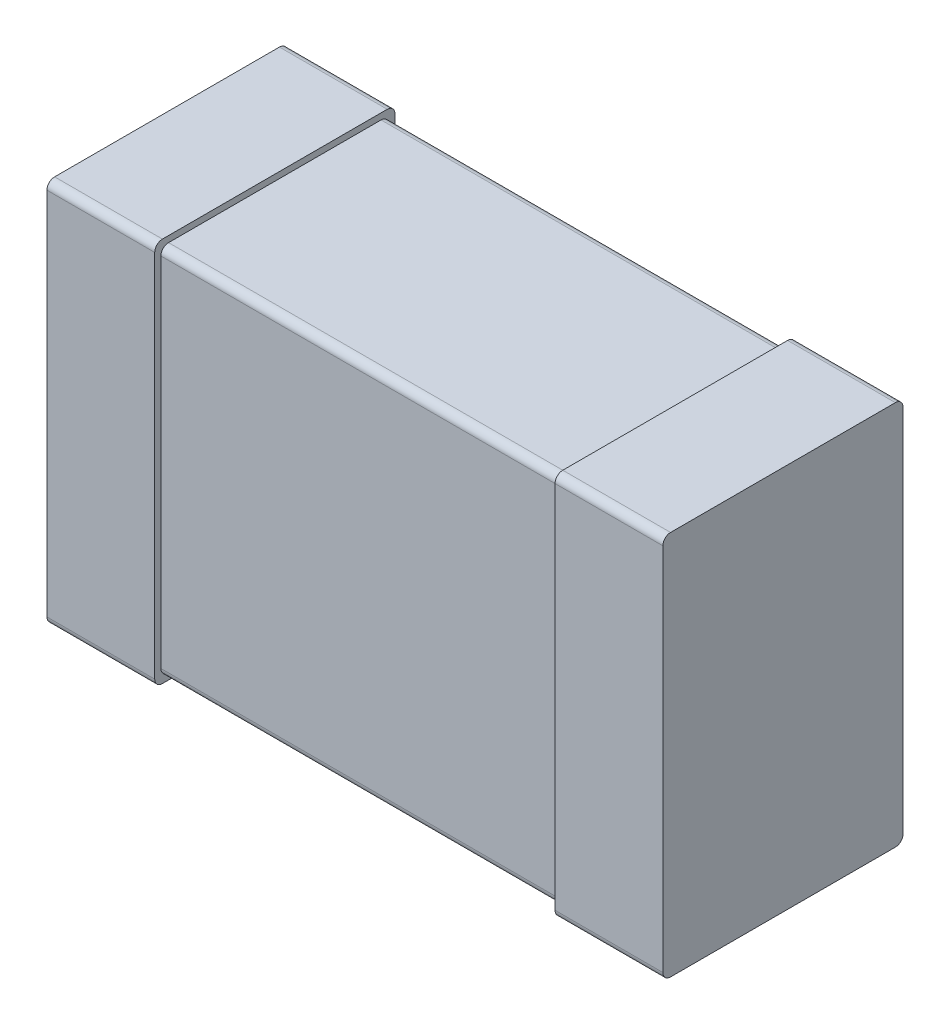
ISO-10303-21;
HEADER;
FILE_DESCRIPTION(('STEP AP214'),'2;1');
FILE_NAME('part.step','',(''),(''),'','','');
FILE_SCHEMA(('AUTOMOTIVE_DESIGN { 1 0 10303 214 1 1 1 1 }'));
ENDSEC;
DATA;
#1=APPLICATION_CONTEXT('core data for automotive mechanical design processes');
#2=APPLICATION_PROTOCOL_DEFINITION('international standard','automotive_design',2000,#1);
#3=PRODUCT_CONTEXT('',#1,'mechanical');
#4=PRODUCT('Part','Part','',(#3));
#5=PRODUCT_RELATED_PRODUCT_CATEGORY('part','',(#4));
#6=PRODUCT_DEFINITION_FORMATION('','',#4);
#7=PRODUCT_DEFINITION_CONTEXT('part definition',#1,'design');
#8=PRODUCT_DEFINITION('design','',#6,#7);
#9=PRODUCT_DEFINITION_SHAPE('','',#8);
#10=(LENGTH_UNIT() NAMED_UNIT(*) SI_UNIT(.MILLI.,.METRE.));
#11=(NAMED_UNIT(*) PLANE_ANGLE_UNIT() SI_UNIT($,.RADIAN.));
#12=(NAMED_UNIT(*) SI_UNIT($,.STERADIAN.) SOLID_ANGLE_UNIT());
#13=UNCERTAINTY_MEASURE_WITH_UNIT(LENGTH_MEASURE(1.E-05),#10,'distance_accuracy_value','');
#14=(GEOMETRIC_REPRESENTATION_CONTEXT(3) GLOBAL_UNCERTAINTY_ASSIGNED_CONTEXT((#13)) GLOBAL_UNIT_ASSIGNED_CONTEXT((#10,
#11,#12)) REPRESENTATION_CONTEXT('',''));
#15=CARTESIAN_POINT('',(0.,0.,0.));
#16=DIRECTION('',(0.,0.,1.));
#17=DIRECTION('',(1.,0.,0.));
#18=AXIS2_PLACEMENT_3D('',#15,#16,#17);
#19=CARTESIAN_POINT('',(-1.,-0.625,0.));
#20=DIRECTION('',(1.,0.,0.));
#21=DIRECTION('',(0.,0.,-1.));
#22=AXIS2_PLACEMENT_3D('',#19,#20,#21);
#23=PLANE('',#22);
#24=DIRECTION('',(0.,1.,0.));
#25=VECTOR('',#24,1.);
#26=CARTESIAN_POINT('',(-1.,-0.625,0.78));
#27=LINE('',#26,#25);
#28=CARTESIAN_POINT('',(-1.,0.6,0.78));
#29=VERTEX_POINT('',#28);
#30=CARTESIAN_POINT('',(-1.,-0.6,0.78));
#31=VERTEX_POINT('',#30);
#32=EDGE_CURVE('E294',#29,#31,#27,.F.);
#33=ORIENTED_EDGE('',*,*,#32,.F.);
#34=CARTESIAN_POINT('',(-1.,0.6,0.755));
#35=DIRECTION('',(1.,0.,0.));
#36=DIRECTION('',(0.,0.,-1.));
#37=AXIS2_PLACEMENT_3D('',#34,#35,#36);
#38=CIRCLE('',#37,0.025);
#39=CARTESIAN_POINT('',(-1.,0.625,0.755));
#40=VERTEX_POINT('',#39);
#41=EDGE_CURVE('E298',#40,#29,#38,.T.);
#42=ORIENTED_EDGE('',*,*,#41,.F.);
#43=DIRECTION('',(0.,0.,1.));
#44=VECTOR('',#43,1.);
#45=CARTESIAN_POINT('',(-1.,0.625,0.));
#46=LINE('',#45,#44);
#47=CARTESIAN_POINT('',(-1.,0.625,0.025));
#48=VERTEX_POINT('',#47);
#49=EDGE_CURVE('E302',#48,#40,#46,.T.);
#50=ORIENTED_EDGE('',*,*,#49,.F.);
#51=CARTESIAN_POINT('',(-1.,0.6,0.025));
#52=DIRECTION('',(1.,0.,0.));
#53=DIRECTION('',(0.,0.,-1.));
#54=AXIS2_PLACEMENT_3D('',#51,#52,#53);
#55=CIRCLE('',#54,0.025);
#56=CARTESIAN_POINT('',(-1.,0.6,0.));
#57=VERTEX_POINT('',#56);
#58=EDGE_CURVE('E303',#57,#48,#55,.T.);
#59=ORIENTED_EDGE('',*,*,#58,.F.);
#60=DIRECTION('',(0.,1.,0.));
#61=VECTOR('',#60,1.);
#62=CARTESIAN_POINT('',(-1.,-0.625,0.));
#63=LINE('',#62,#61);
#64=CARTESIAN_POINT('',(-1.,-0.6,0.));
#65=VERTEX_POINT('',#64);
#66=EDGE_CURVE('E310',#57,#65,#63,.F.);
#67=ORIENTED_EDGE('',*,*,#66,.T.);
#68=CARTESIAN_POINT('',(-1.,-0.6,0.025));
#69=DIRECTION('',(1.,0.,0.));
#70=DIRECTION('',(0.,0.,-1.));
#71=AXIS2_PLACEMENT_3D('',#68,#69,#70);
#72=CIRCLE('',#71,0.025);
#73=CARTESIAN_POINT('',(-1.,-0.625,0.025));
#74=VERTEX_POINT('',#73);
#75=EDGE_CURVE('E314',#74,#65,#72,.T.);
#76=ORIENTED_EDGE('',*,*,#75,.F.);
#77=DIRECTION('',(0.,0.,1.));
#78=VECTOR('',#77,1.);
#79=CARTESIAN_POINT('',(-1.,-0.625,0.));
#80=LINE('',#79,#78);
#81=CARTESIAN_POINT('',(-1.,-0.625,0.755));
#82=VERTEX_POINT('',#81);
#83=EDGE_CURVE('E323',#74,#82,#80,.T.);
#84=ORIENTED_EDGE('',*,*,#83,.T.);
#85=CARTESIAN_POINT('',(-1.,-0.6,0.755));
#86=DIRECTION('',(1.,0.,0.));
#87=DIRECTION('',(0.,0.,-1.));
#88=AXIS2_PLACEMENT_3D('',#85,#86,#87);
#89=CIRCLE('',#88,0.025);
#90=EDGE_CURVE('E291',#31,#82,#89,.T.);
#91=ORIENTED_EDGE('',*,*,#90,.F.);
#92=EDGE_LOOP('',(#33,#42,#50,#59,#67,#76,#84,#91));
#93=FACE_BOUND('',#92,.T.);
#94=ADVANCED_FACE('F17',(#93),#23,.F.);
#95=CARTESIAN_POINT('',(1.,-0.625,0.));
#96=DIRECTION('',(1.,0.,0.));
#97=DIRECTION('',(0.,0.,-1.));
#98=AXIS2_PLACEMENT_3D('',#95,#96,#97);
#99=PLANE('',#98);
#100=DIRECTION('',(0.,1.,0.));
#101=VECTOR('',#100,1.);
#102=CARTESIAN_POINT('',(1.,-0.625,0.78));
#103=LINE('',#102,#101);
#104=CARTESIAN_POINT('',(1.,-0.6,0.78));
#105=VERTEX_POINT('',#104);
#106=CARTESIAN_POINT('',(1.,0.6,0.78));
#107=VERTEX_POINT('',#106);
#108=EDGE_CURVE('E268',#105,#107,#103,.T.);
#109=ORIENTED_EDGE('',*,*,#108,.F.);
#110=CARTESIAN_POINT('',(1.,-0.6,0.755));
#111=DIRECTION('',(1.,0.,0.));
#112=DIRECTION('',(0.,0.,-1.));
#113=AXIS2_PLACEMENT_3D('',#110,#111,#112);
#114=CIRCLE('',#113,0.025);
#115=CARTESIAN_POINT('',(1.,-0.625,0.755));
#116=VERTEX_POINT('',#115);
#117=EDGE_CURVE('E262',#116,#105,#114,.F.);
#118=ORIENTED_EDGE('',*,*,#117,.F.);
#119=DIRECTION('',(0.,0.,1.));
#120=VECTOR('',#119,1.);
#121=CARTESIAN_POINT('',(1.,-0.625,0.));
#122=LINE('',#121,#120);
#123=CARTESIAN_POINT('',(1.,-0.625,0.025));
#124=VERTEX_POINT('',#123);
#125=EDGE_CURVE('E316',#116,#124,#122,.F.);
#126=ORIENTED_EDGE('',*,*,#125,.T.);
#127=CARTESIAN_POINT('',(1.,-0.6,0.025));
#128=DIRECTION('',(1.,0.,0.));
#129=DIRECTION('',(0.,0.,-1.));
#130=AXIS2_PLACEMENT_3D('',#127,#128,#129);
#131=CIRCLE('',#130,0.025);
#132=CARTESIAN_POINT('',(1.,-0.6,0.));
#133=VERTEX_POINT('',#132);
#134=EDGE_CURVE('E284',#133,#124,#131,.F.);
#135=ORIENTED_EDGE('',*,*,#134,.F.);
#136=DIRECTION('',(0.,1.,0.));
#137=VECTOR('',#136,1.);
#138=CARTESIAN_POINT('',(1.,-0.625,0.));
#139=LINE('',#138,#137);
#140=CARTESIAN_POINT('',(1.,0.6,0.));
#141=VERTEX_POINT('',#140);
#142=EDGE_CURVE('E281',#133,#141,#139,.T.);
#143=ORIENTED_EDGE('',*,*,#142,.T.);
#144=CARTESIAN_POINT('',(1.,0.6,0.025));
#145=DIRECTION('',(1.,0.,0.));
#146=DIRECTION('',(0.,0.,-1.));
#147=AXIS2_PLACEMENT_3D('',#144,#145,#146);
#148=CIRCLE('',#147,0.025);
#149=CARTESIAN_POINT('',(1.,0.625,0.025));
#150=VERTEX_POINT('',#149);
#151=EDGE_CURVE('E277',#150,#141,#148,.F.);
#152=ORIENTED_EDGE('',*,*,#151,.F.);
#153=DIRECTION('',(0.,0.,1.));
#154=VECTOR('',#153,1.);
#155=CARTESIAN_POINT('',(1.,0.625,0.));
#156=LINE('',#155,#154);
#157=CARTESIAN_POINT('',(1.,0.625,0.755));
#158=VERTEX_POINT('',#157);
#159=EDGE_CURVE('E274',#158,#150,#156,.F.);
#160=ORIENTED_EDGE('',*,*,#159,.F.);
#161=CARTESIAN_POINT('',(1.,0.6,0.755));
#162=DIRECTION('',(1.,0.,0.));
#163=DIRECTION('',(0.,0.,-1.));
#164=AXIS2_PLACEMENT_3D('',#161,#162,#163);
#165=CIRCLE('',#164,0.025);
#166=EDGE_CURVE('E271',#107,#158,#165,.F.);
#167=ORIENTED_EDGE('',*,*,#166,.F.);
#168=EDGE_LOOP('',(#109,#118,#126,#135,#143,#152,#160,#167));
#169=FACE_BOUND('',#168,.T.);
#170=ADVANCED_FACE('F392',(#169),#99,.T.);
#171=CARTESIAN_POINT('',(-0.65,-0.58,0.735));
#172=DIRECTION('',(1.,0.,0.));
#173=DIRECTION('',(0.,0.,-1.));
#174=AXIS2_PLACEMENT_3D('',#171,#172,#173);
#175=CYLINDRICAL_SURFACE('',#174,0.025);
#176=DIRECTION('',(1.,0.,0.));
#177=VECTOR('',#176,1.);
#178=CARTESIAN_POINT('',(-0.65,-0.58,0.76));
#179=LINE('',#178,#177);
#180=CARTESIAN_POINT('',(-0.65,-0.58,0.76));
#181=VERTEX_POINT('',#180);
#182=CARTESIAN_POINT('',(0.65,-0.58,0.76));
#183=VERTEX_POINT('',#182);
#184=EDGE_CURVE('E177',#181,#183,#179,.T.);
#185=ORIENTED_EDGE('',*,*,#184,.F.);
#186=CARTESIAN_POINT('',(-0.65,-0.58,0.735));
#187=DIRECTION('',(1.,0.,0.));
#188=DIRECTION('',(0.,0.,-1.));
#189=AXIS2_PLACEMENT_3D('',#186,#187,#188);
#190=CIRCLE('',#189,0.025);
#191=CARTESIAN_POINT('',(-0.65,-0.605,0.735));
#192=VERTEX_POINT('',#191);
#193=EDGE_CURVE('E182',#181,#192,#190,.T.);
#194=ORIENTED_EDGE('',*,*,#193,.T.);
#195=DIRECTION('',(1.,0.,0.));
#196=VECTOR('',#195,1.);
#197=CARTESIAN_POINT('',(-0.65,-0.605,0.735));
#198=LINE('',#197,#196);
#199=CARTESIAN_POINT('',(0.65,-0.605,0.735));
#200=VERTEX_POINT('',#199);
#201=EDGE_CURVE('E180',#192,#200,#198,.T.);
#202=ORIENTED_EDGE('',*,*,#201,.T.);
#203=CARTESIAN_POINT('',(0.65,-0.58,0.735));
#204=DIRECTION('',(1.,0.,0.));
#205=DIRECTION('',(0.,0.,-1.));
#206=AXIS2_PLACEMENT_3D('',#203,#204,#205);
#207=CIRCLE('',#206,0.025);
#208=EDGE_CURVE('E20',#200,#183,#207,.F.);
#209=ORIENTED_EDGE('',*,*,#208,.T.);
#210=EDGE_LOOP('',(#185,#194,#202,#209));
#211=FACE_BOUND('',#210,.T.);
#212=ADVANCED_FACE('F176',(#211),#175,.T.);
#213=CARTESIAN_POINT('',(-0.65,0.58,0.735));
#214=DIRECTION('',(1.,0.,0.));
#215=DIRECTION('',(0.,0.,-1.));
#216=AXIS2_PLACEMENT_3D('',#213,#214,#215);
#217=CYLINDRICAL_SURFACE('',#216,0.025);
#218=CARTESIAN_POINT('',(0.65,0.58,0.735));
#219=DIRECTION('',(1.,0.,0.));
#220=DIRECTION('',(0.,0.,-1.));
#221=AXIS2_PLACEMENT_3D('',#218,#219,#220);
#222=CIRCLE('',#221,0.025);
#223=CARTESIAN_POINT('',(0.65,0.58,0.76));
#224=VERTEX_POINT('',#223);
#225=CARTESIAN_POINT('',(0.65,0.605,0.735));
#226=VERTEX_POINT('',#225);
#227=EDGE_CURVE('E195',#224,#226,#222,.F.);
#228=ORIENTED_EDGE('',*,*,#227,.T.);
#229=DIRECTION('',(1.,0.,0.));
#230=VECTOR('',#229,1.);
#231=CARTESIAN_POINT('',(-0.65,0.605,0.735));
#232=LINE('',#231,#230);
#233=CARTESIAN_POINT('',(-0.65,0.605,0.735));
#234=VERTEX_POINT('',#233);
#235=EDGE_CURVE('E252',#234,#226,#232,.T.);
#236=ORIENTED_EDGE('',*,*,#235,.F.);
#237=CARTESIAN_POINT('',(-0.65,0.58,0.735));
#238=DIRECTION('',(1.,0.,0.));
#239=DIRECTION('',(0.,0.,-1.));
#240=AXIS2_PLACEMENT_3D('',#237,#238,#239);
#241=CIRCLE('',#240,0.025);
#242=CARTESIAN_POINT('',(-0.65,0.58,0.76));
#243=VERTEX_POINT('',#242);
#244=EDGE_CURVE('E357',#234,#243,#241,.T.);
#245=ORIENTED_EDGE('',*,*,#244,.T.);
#246=DIRECTION('',(1.,0.,0.));
#247=VECTOR('',#246,1.);
#248=CARTESIAN_POINT('',(-0.65,0.58,0.76));
#249=LINE('',#248,#247);
#250=EDGE_CURVE('E190',#224,#243,#249,.F.);
#251=ORIENTED_EDGE('',*,*,#250,.F.);
#252=EDGE_LOOP('',(#228,#236,#245,#251));
#253=FACE_BOUND('',#252,.T.);
#254=ADVANCED_FACE('F380',(#253),#217,.T.);
#255=CARTESIAN_POINT('',(-1.,-0.625,0.));
#256=DIRECTION('',(0.,1.,0.));
#257=DIRECTION('',(0.,0.,1.));
#258=AXIS2_PLACEMENT_3D('',#255,#256,#257);
#259=PLANE('',#258);
#260=ORIENTED_EDGE('',*,*,#83,.F.);
#261=DIRECTION('',(1.,0.,0.));
#262=VECTOR('',#261,1.);
#263=CARTESIAN_POINT('',(-1.,-0.625,0.025));
#264=LINE('',#263,#262);
#265=CARTESIAN_POINT('',(-0.65,-0.625,0.025));
#266=VERTEX_POINT('',#265);
#267=EDGE_CURVE('E311',#266,#74,#264,.F.);
#268=ORIENTED_EDGE('',*,*,#267,.F.);
#269=DIRECTION('',(0.,0.,-1.));
#270=VECTOR('',#269,1.);
#271=CARTESIAN_POINT('',(-0.65,-0.625,0.));
#272=LINE('',#271,#270);
#273=CARTESIAN_POINT('',(-0.65,-0.625,0.755));
#274=VERTEX_POINT('',#273);
#275=EDGE_CURVE('E250',#274,#266,#272,.T.);
#276=ORIENTED_EDGE('',*,*,#275,.F.);
#277=DIRECTION('',(1.,0.,0.));
#278=VECTOR('',#277,1.);
#279=CARTESIAN_POINT('',(-1.,-0.625,0.755));
#280=LINE('',#279,#278);
#281=EDGE_CURVE('E285',#82,#274,#280,.T.);
#282=ORIENTED_EDGE('',*,*,#281,.F.);
#283=EDGE_LOOP('',(#260,#268,#276,#282));
#284=FACE_BOUND('',#283,.T.);
#285=ADVANCED_FACE('F382',(#284),#259,.F.);
#286=CARTESIAN_POINT('',(-1.,-0.6,0.025));
#287=DIRECTION('',(1.,0.,0.));
#288=DIRECTION('',(0.,0.,-1.));
#289=AXIS2_PLACEMENT_3D('',#286,#287,#288);
#290=CYLINDRICAL_SURFACE('',#289,0.025);
#291=CARTESIAN_POINT('',(-0.65,-0.6,0.025));
#292=DIRECTION('',(1.,0.,0.));
#293=DIRECTION('',(0.,0.,-1.));
#294=AXIS2_PLACEMENT_3D('',#291,#292,#293);
#295=CIRCLE('',#294,0.025);
#296=CARTESIAN_POINT('',(-0.65,-0.6,0.));
#297=VERTEX_POINT('',#296);
#298=EDGE_CURVE('E249',#266,#297,#295,.T.);
#299=ORIENTED_EDGE('',*,*,#298,.F.);
#300=ORIENTED_EDGE('',*,*,#267,.T.);
#301=ORIENTED_EDGE('',*,*,#75,.T.);
#302=DIRECTION('',(1.,0.,0.));
#303=VECTOR('',#302,1.);
#304=CARTESIAN_POINT('',(-1.,-0.6,0.));
#305=LINE('',#304,#303);
#306=EDGE_CURVE('E307',#65,#297,#305,.T.);
#307=ORIENTED_EDGE('',*,*,#306,.T.);
#308=EDGE_LOOP('',(#299,#300,#301,#307));
#309=FACE_BOUND('',#308,.T.);
#310=ADVANCED_FACE('F389',(#309),#290,.T.);
#311=CARTESIAN_POINT('',(-1.,-0.625,0.));
#312=DIRECTION('',(0.,0.,1.));
#313=DIRECTION('',(1.,0.,0.));
#314=AXIS2_PLACEMENT_3D('',#311,#312,#313);
#315=PLANE('',#314);
#316=DIRECTION('',(0.,1.,0.));
#317=VECTOR('',#316,1.);
#318=CARTESIAN_POINT('',(-0.65,-0.625,0.));
#319=LINE('',#318,#317);
#320=CARTESIAN_POINT('',(-0.65,0.6,0.));
#321=VERTEX_POINT('',#320);
#322=EDGE_CURVE('E247',#297,#321,#319,.T.);
#323=ORIENTED_EDGE('',*,*,#322,.F.);
#324=ORIENTED_EDGE('',*,*,#306,.F.);
#325=ORIENTED_EDGE('',*,*,#66,.F.);
#326=DIRECTION('',(1.,0.,0.));
#327=VECTOR('',#326,1.);
#328=CARTESIAN_POINT('',(-1.,0.6,0.));
#329=LINE('',#328,#327);
#330=EDGE_CURVE('E304',#321,#57,#329,.F.);
#331=ORIENTED_EDGE('',*,*,#330,.F.);
#332=EDGE_LOOP('',(#323,#324,#325,#331));
#333=FACE_BOUND('',#332,.T.);
#334=ADVANCED_FACE('F464',(#333),#315,.F.);
#335=CARTESIAN_POINT('',(-1.,0.6,0.025));
#336=DIRECTION('',(1.,0.,0.));
#337=DIRECTION('',(0.,0.,-1.));
#338=AXIS2_PLACEMENT_3D('',#335,#336,#337);
#339=CYLINDRICAL_SURFACE('',#338,0.025);
#340=ORIENTED_EDGE('',*,*,#330,.T.);
#341=ORIENTED_EDGE('',*,*,#58,.T.);
#342=DIRECTION('',(1.,0.,0.));
#343=VECTOR('',#342,1.);
#344=CARTESIAN_POINT('',(-1.,0.625,0.025));
#345=LINE('',#344,#343);
#346=CARTESIAN_POINT('',(-0.65,0.625,0.025));
#347=VERTEX_POINT('',#346);
#348=EDGE_CURVE('E299',#347,#48,#345,.F.);
#349=ORIENTED_EDGE('',*,*,#348,.F.);
#350=CARTESIAN_POINT('',(-0.65,0.6,0.025));
#351=DIRECTION('',(1.,0.,0.));
#352=DIRECTION('',(0.,0.,-1.));
#353=AXIS2_PLACEMENT_3D('',#350,#351,#352);
#354=CIRCLE('',#353,0.025);
#355=EDGE_CURVE('E246',#321,#347,#354,.T.);
#356=ORIENTED_EDGE('',*,*,#355,.F.);
#357=EDGE_LOOP('',(#340,#341,#349,#356));
#358=FACE_BOUND('',#357,.T.);
#359=ADVANCED_FACE('F460',(#358),#339,.T.);
#360=CARTESIAN_POINT('',(-1.,0.625,0.));
#361=DIRECTION('',(0.,1.,0.));
#362=DIRECTION('',(0.,0.,1.));
#363=AXIS2_PLACEMENT_3D('',#360,#361,#362);
#364=PLANE('',#363);
#365=ORIENTED_EDGE('',*,*,#49,.T.);
#366=DIRECTION('',(1.,0.,0.));
#367=VECTOR('',#366,1.);
#368=CARTESIAN_POINT('',(-1.,0.625,0.755));
#369=LINE('',#368,#367);
#370=CARTESIAN_POINT('',(-0.65,0.625,0.755));
#371=VERTEX_POINT('',#370);
#372=EDGE_CURVE('E295',#371,#40,#369,.F.);
#373=ORIENTED_EDGE('',*,*,#372,.F.);
#374=DIRECTION('',(0.,0.,-1.));
#375=VECTOR('',#374,1.);
#376=CARTESIAN_POINT('',(-0.65,0.625,0.));
#377=LINE('',#376,#375);
#378=EDGE_CURVE('E244',#347,#371,#377,.F.);
#379=ORIENTED_EDGE('',*,*,#378,.F.);
#380=ORIENTED_EDGE('',*,*,#348,.T.);
#381=EDGE_LOOP('',(#365,#373,#379,#380));
#382=FACE_BOUND('',#381,.T.);
#383=ADVANCED_FACE('F456',(#382),#364,.T.);
#384=CARTESIAN_POINT('',(-1.,0.6,0.755));
#385=DIRECTION('',(1.,0.,0.));
#386=DIRECTION('',(0.,0.,-1.));
#387=AXIS2_PLACEMENT_3D('',#384,#385,#386);
#388=CYLINDRICAL_SURFACE('',#387,0.025);
#389=CARTESIAN_POINT('',(-0.65,0.6,0.755));
#390=DIRECTION('',(1.,0.,0.));
#391=DIRECTION('',(0.,0.,-1.));
#392=AXIS2_PLACEMENT_3D('',#389,#390,#391);
#393=CIRCLE('',#392,0.025);
#394=CARTESIAN_POINT('',(-0.65,0.6,0.78));
#395=VERTEX_POINT('',#394);
#396=EDGE_CURVE('E243',#371,#395,#393,.T.);
#397=ORIENTED_EDGE('',*,*,#396,.F.);
#398=ORIENTED_EDGE('',*,*,#372,.T.);
#399=ORIENTED_EDGE('',*,*,#41,.T.);
#400=DIRECTION('',(1.,0.,0.));
#401=VECTOR('',#400,1.);
#402=CARTESIAN_POINT('',(-1.,0.6,0.78));
#403=LINE('',#402,#401);
#404=EDGE_CURVE('E288',#395,#29,#403,.F.);
#405=ORIENTED_EDGE('',*,*,#404,.F.);
#406=EDGE_LOOP('',(#397,#398,#399,#405));
#407=FACE_BOUND('',#406,.T.);
#408=ADVANCED_FACE('F452',(#407),#388,.T.);
#409=CARTESIAN_POINT('',(-1.,-0.625,0.78));
#410=DIRECTION('',(0.,0.,1.));
#411=DIRECTION('',(1.,0.,0.));
#412=AXIS2_PLACEMENT_3D('',#409,#410,#411);
#413=PLANE('',#412);
#414=DIRECTION('',(0.,1.,0.));
#415=VECTOR('',#414,1.);
#416=CARTESIAN_POINT('',(-0.65,-0.625,0.78));
#417=LINE('',#416,#415);
#418=CARTESIAN_POINT('',(-0.65,-0.6,0.78));
#419=VERTEX_POINT('',#418);
#420=EDGE_CURVE('E241',#395,#419,#417,.F.);
#421=ORIENTED_EDGE('',*,*,#420,.F.);
#422=ORIENTED_EDGE('',*,*,#404,.T.);
#423=ORIENTED_EDGE('',*,*,#32,.T.);
#424=DIRECTION('',(1.,0.,0.));
#425=VECTOR('',#424,1.);
#426=CARTESIAN_POINT('',(-1.,-0.6,0.78));
#427=LINE('',#426,#425);
#428=EDGE_CURVE('E287',#419,#31,#427,.F.);
#429=ORIENTED_EDGE('',*,*,#428,.F.);
#430=EDGE_LOOP('',(#421,#422,#423,#429));
#431=FACE_BOUND('',#430,.T.);
#432=ADVANCED_FACE('F448',(#431),#413,.T.);
#433=CARTESIAN_POINT('',(-1.,-0.6,0.755));
#434=DIRECTION('',(1.,0.,0.));
#435=DIRECTION('',(0.,0.,-1.));
#436=AXIS2_PLACEMENT_3D('',#433,#434,#435);
#437=CYLINDRICAL_SURFACE('',#436,0.025);
#438=ORIENTED_EDGE('',*,*,#428,.T.);
#439=ORIENTED_EDGE('',*,*,#90,.T.);
#440=ORIENTED_EDGE('',*,*,#281,.T.);
#441=CARTESIAN_POINT('',(-0.65,-0.6,0.755));
#442=DIRECTION('',(1.,0.,0.));
#443=DIRECTION('',(0.,0.,-1.));
#444=AXIS2_PLACEMENT_3D('',#441,#442,#443);
#445=CIRCLE('',#444,0.025);
#446=EDGE_CURVE('E240',#419,#274,#445,.T.);
#447=ORIENTED_EDGE('',*,*,#446,.F.);
#448=EDGE_LOOP('',(#438,#439,#440,#447));
#449=FACE_BOUND('',#448,.T.);
#450=ADVANCED_FACE('F444',(#449),#437,.T.);
#451=CARTESIAN_POINT('',(0.65,-0.625,0.));
#452=DIRECTION('',(0.,1.,0.));
#453=DIRECTION('',(0.,0.,1.));
#454=AXIS2_PLACEMENT_3D('',#451,#452,#453);
#455=PLANE('',#454);
#456=DIRECTION('',(0.,0.,-1.));
#457=VECTOR('',#456,1.);
#458=CARTESIAN_POINT('',(0.65,-0.625,0.));
#459=LINE('',#458,#457);
#460=CARTESIAN_POINT('',(0.65,-0.625,0.755));
#461=VERTEX_POINT('',#460);
#462=CARTESIAN_POINT('',(0.65,-0.625,0.025));
#463=VERTEX_POINT('',#462);
#464=EDGE_CURVE('E219',#461,#463,#459,.T.);
#465=ORIENTED_EDGE('',*,*,#464,.T.);
#466=DIRECTION('',(1.,0.,0.));
#467=VECTOR('',#466,1.);
#468=CARTESIAN_POINT('',(0.65,-0.625,0.025));
#469=LINE('',#468,#467);
#470=EDGE_CURVE('E282',#124,#463,#469,.F.);
#471=ORIENTED_EDGE('',*,*,#470,.F.);
#472=ORIENTED_EDGE('',*,*,#125,.F.);
#473=DIRECTION('',(1.,0.,0.));
#474=VECTOR('',#473,1.);
#475=CARTESIAN_POINT('',(0.65,-0.625,0.755));
#476=LINE('',#475,#474);
#477=EDGE_CURVE('E263',#461,#116,#476,.T.);
#478=ORIENTED_EDGE('',*,*,#477,.F.);
#479=EDGE_LOOP('',(#465,#471,#472,#478));
#480=FACE_BOUND('',#479,.T.);
#481=ADVANCED_FACE('F440',(#480),#455,.F.);
#482=CARTESIAN_POINT('',(0.65,-0.6,0.025));
#483=DIRECTION('',(1.,0.,0.));
#484=DIRECTION('',(0.,0.,-1.));
#485=AXIS2_PLACEMENT_3D('',#482,#483,#484);
#486=CYLINDRICAL_SURFACE('',#485,0.025);
#487=ORIENTED_EDGE('',*,*,#134,.T.);
#488=ORIENTED_EDGE('',*,*,#470,.T.);
#489=CARTESIAN_POINT('',(0.65,-0.6,0.025));
#490=DIRECTION('',(1.,0.,0.));
#491=DIRECTION('',(0.,0.,-1.));
#492=AXIS2_PLACEMENT_3D('',#489,#490,#491);
#493=CIRCLE('',#492,0.025);
#494=CARTESIAN_POINT('',(0.65,-0.6,0.));
#495=VERTEX_POINT('',#494);
#496=EDGE_CURVE('E218',#463,#495,#493,.T.);
#497=ORIENTED_EDGE('',*,*,#496,.T.);
#498=DIRECTION('',(1.,0.,0.));
#499=VECTOR('',#498,1.);
#500=CARTESIAN_POINT('',(0.65,-0.6,0.));
#501=LINE('',#500,#499);
#502=EDGE_CURVE('E278',#495,#133,#501,.T.);
#503=ORIENTED_EDGE('',*,*,#502,.T.);
#504=EDGE_LOOP('',(#487,#488,#497,#503));
#505=FACE_BOUND('',#504,.T.);
#506=ADVANCED_FACE('F436',(#505),#486,.T.);
#507=CARTESIAN_POINT('',(0.65,-0.625,0.));
#508=DIRECTION('',(0.,0.,1.));
#509=DIRECTION('',(1.,0.,0.));
#510=AXIS2_PLACEMENT_3D('',#507,#508,#509);
#511=PLANE('',#510);
#512=ORIENTED_EDGE('',*,*,#142,.F.);
#513=ORIENTED_EDGE('',*,*,#502,.F.);
#514=DIRECTION('',(0.,1.,0.));
#515=VECTOR('',#514,1.);
#516=CARTESIAN_POINT('',(0.65,-0.625,0.));
#517=LINE('',#516,#515);
#518=CARTESIAN_POINT('',(0.65,0.6,0.));
#519=VERTEX_POINT('',#518);
#520=EDGE_CURVE('E215',#495,#519,#517,.T.);
#521=ORIENTED_EDGE('',*,*,#520,.T.);
#522=DIRECTION('',(1.,0.,0.));
#523=VECTOR('',#522,1.);
#524=CARTESIAN_POINT('',(0.65,0.6,0.));
#525=LINE('',#524,#523);
#526=EDGE_CURVE('E275',#141,#519,#525,.F.);
#527=ORIENTED_EDGE('',*,*,#526,.F.);
#528=EDGE_LOOP('',(#512,#513,#521,#527));
#529=FACE_BOUND('',#528,.T.);
#530=ADVANCED_FACE('F432',(#529),#511,.F.);
#531=CARTESIAN_POINT('',(0.65,0.6,0.025));
#532=DIRECTION('',(1.,0.,0.));
#533=DIRECTION('',(0.,0.,-1.));
#534=AXIS2_PLACEMENT_3D('',#531,#532,#533);
#535=CYLINDRICAL_SURFACE('',#534,0.025);
#536=ORIENTED_EDGE('',*,*,#526,.T.);
#537=CARTESIAN_POINT('',(0.65,0.6,0.025));
#538=DIRECTION('',(1.,0.,0.));
#539=DIRECTION('',(0.,0.,-1.));
#540=AXIS2_PLACEMENT_3D('',#537,#538,#539);
#541=CIRCLE('',#540,0.025);
#542=CARTESIAN_POINT('',(0.65,0.625,0.025));
#543=VERTEX_POINT('',#542);
#544=EDGE_CURVE('E214',#519,#543,#541,.T.);
#545=ORIENTED_EDGE('',*,*,#544,.T.);
#546=DIRECTION('',(1.,0.,0.));
#547=VECTOR('',#546,1.);
#548=CARTESIAN_POINT('',(0.65,0.625,0.025));
#549=LINE('',#548,#547);
#550=EDGE_CURVE('E272',#150,#543,#549,.F.);
#551=ORIENTED_EDGE('',*,*,#550,.F.);
#552=ORIENTED_EDGE('',*,*,#151,.T.);
#553=EDGE_LOOP('',(#536,#545,#551,#552));
#554=FACE_BOUND('',#553,.T.);
#555=ADVANCED_FACE('F428',(#554),#535,.T.);
#556=CARTESIAN_POINT('',(0.65,0.625,0.));
#557=DIRECTION('',(0.,1.,0.));
#558=DIRECTION('',(0.,0.,1.));
#559=AXIS2_PLACEMENT_3D('',#556,#557,#558);
#560=PLANE('',#559);
#561=DIRECTION('',(0.,0.,-1.));
#562=VECTOR('',#561,1.);
#563=CARTESIAN_POINT('',(0.65,0.625,0.));
#564=LINE('',#563,#562);
#565=CARTESIAN_POINT('',(0.65,0.625,0.755));
#566=VERTEX_POINT('',#565);
#567=EDGE_CURVE('E211',#543,#566,#564,.F.);
#568=ORIENTED_EDGE('',*,*,#567,.T.);
#569=DIRECTION('',(1.,0.,0.));
#570=VECTOR('',#569,1.);
#571=CARTESIAN_POINT('',(0.65,0.625,0.755));
#572=LINE('',#571,#570);
#573=EDGE_CURVE('E269',#158,#566,#572,.F.);
#574=ORIENTED_EDGE('',*,*,#573,.F.);
#575=ORIENTED_EDGE('',*,*,#159,.T.);
#576=ORIENTED_EDGE('',*,*,#550,.T.);
#577=EDGE_LOOP('',(#568,#574,#575,#576));
#578=FACE_BOUND('',#577,.T.);
#579=ADVANCED_FACE('F424',(#578),#560,.T.);
#580=CARTESIAN_POINT('',(0.65,0.6,0.755));
#581=DIRECTION('',(1.,0.,0.));
#582=DIRECTION('',(0.,0.,-1.));
#583=AXIS2_PLACEMENT_3D('',#580,#581,#582);
#584=CYLINDRICAL_SURFACE('',#583,0.025);
#585=ORIENTED_EDGE('',*,*,#166,.T.);
#586=ORIENTED_EDGE('',*,*,#573,.T.);
#587=CARTESIAN_POINT('',(0.65,0.6,0.755));
#588=DIRECTION('',(1.,0.,0.));
#589=DIRECTION('',(0.,0.,-1.));
#590=AXIS2_PLACEMENT_3D('',#587,#588,#589);
#591=CIRCLE('',#590,0.025);
#592=CARTESIAN_POINT('',(0.65,0.6,0.78));
#593=VERTEX_POINT('',#592);
#594=EDGE_CURVE('E210',#566,#593,#591,.T.);
#595=ORIENTED_EDGE('',*,*,#594,.T.);
#596=DIRECTION('',(1.,0.,0.));
#597=VECTOR('',#596,1.);
#598=CARTESIAN_POINT('',(0.65,0.6,0.78));
#599=LINE('',#598,#597);
#600=EDGE_CURVE('E266',#107,#593,#599,.F.);
#601=ORIENTED_EDGE('',*,*,#600,.F.);
#602=EDGE_LOOP('',(#585,#586,#595,#601));
#603=FACE_BOUND('',#602,.T.);
#604=ADVANCED_FACE('F420',(#603),#584,.T.);
#605=CARTESIAN_POINT('',(0.65,-0.625,0.78));
#606=DIRECTION('',(0.,0.,1.));
#607=DIRECTION('',(1.,0.,0.));
#608=AXIS2_PLACEMENT_3D('',#605,#606,#607);
#609=PLANE('',#608);
#610=ORIENTED_EDGE('',*,*,#108,.T.);
#611=ORIENTED_EDGE('',*,*,#600,.T.);
#612=DIRECTION('',(0.,1.,0.));
#613=VECTOR('',#612,1.);
#614=CARTESIAN_POINT('',(0.65,-0.625,0.78));
#615=LINE('',#614,#613);
#616=CARTESIAN_POINT('',(0.65,-0.6,0.78));
#617=VERTEX_POINT('',#616);
#618=EDGE_CURVE('E206',#593,#617,#615,.F.);
#619=ORIENTED_EDGE('',*,*,#618,.T.);
#620=DIRECTION('',(1.,0.,0.));
#621=VECTOR('',#620,1.);
#622=CARTESIAN_POINT('',(0.65,-0.6,0.78));
#623=LINE('',#622,#621);
#624=EDGE_CURVE('E258',#105,#617,#623,.F.);
#625=ORIENTED_EDGE('',*,*,#624,.F.);
#626=EDGE_LOOP('',(#610,#611,#619,#625));
#627=FACE_BOUND('',#626,.T.);
#628=ADVANCED_FACE('F416',(#627),#609,.T.);
#629=CARTESIAN_POINT('',(0.65,-0.6,0.755));
#630=DIRECTION('',(1.,0.,0.));
#631=DIRECTION('',(0.,0.,-1.));
#632=AXIS2_PLACEMENT_3D('',#629,#630,#631);
#633=CYLINDRICAL_SURFACE('',#632,0.025);
#634=ORIENTED_EDGE('',*,*,#624,.T.);
#635=CARTESIAN_POINT('',(0.65,-0.6,0.755));
#636=DIRECTION('',(1.,0.,0.));
#637=DIRECTION('',(0.,0.,-1.));
#638=AXIS2_PLACEMENT_3D('',#635,#636,#637);
#639=CIRCLE('',#638,0.025);
#640=EDGE_CURVE('E209',#617,#461,#639,.T.);
#641=ORIENTED_EDGE('',*,*,#640,.T.);
#642=ORIENTED_EDGE('',*,*,#477,.T.);
#643=ORIENTED_EDGE('',*,*,#117,.T.);
#644=EDGE_LOOP('',(#634,#641,#642,#643));
#645=FACE_BOUND('',#644,.T.);
#646=ADVANCED_FACE('F413',(#645),#633,.T.);
#647=CARTESIAN_POINT('',(-0.65,-0.605,0.02));
#648=DIRECTION('',(0.,1.,0.));
#649=DIRECTION('',(0.,0.,1.));
#650=AXIS2_PLACEMENT_3D('',#647,#648,#649);
#651=PLANE('',#650);
#652=DIRECTION('',(0.,0.,-1.));
#653=VECTOR('',#652,1.);
#654=CARTESIAN_POINT('',(-0.65,-0.605,0.));
#655=LINE('',#654,#653);
#656=CARTESIAN_POINT('',(-0.65,-0.605,0.045));
#657=VERTEX_POINT('',#656);
#658=EDGE_CURVE('E237',#657,#192,#655,.F.);
#659=ORIENTED_EDGE('',*,*,#658,.F.);
#660=DIRECTION('',(1.,0.,0.));
#661=VECTOR('',#660,1.);
#662=CARTESIAN_POINT('',(-0.65,-0.605,0.045));
#663=LINE('',#662,#661);
#664=CARTESIAN_POINT('',(0.65,-0.605,0.045));
#665=VERTEX_POINT('',#664);
#666=EDGE_CURVE('E222',#665,#657,#663,.F.);
#667=ORIENTED_EDGE('',*,*,#666,.F.);
#668=DIRECTION('',(0.,0.,-1.));
#669=VECTOR('',#668,1.);
#670=CARTESIAN_POINT('',(0.65,-0.605,0.));
#671=LINE('',#670,#669);
#672=EDGE_CURVE('E198',#665,#200,#671,.F.);
#673=ORIENTED_EDGE('',*,*,#672,.T.);
#674=ORIENTED_EDGE('',*,*,#201,.F.);
#675=EDGE_LOOP('',(#659,#667,#673,#674));
#676=FACE_BOUND('',#675,.T.);
#677=ADVANCED_FACE('F360',(#676),#651,.F.);
#678=CARTESIAN_POINT('',(-0.65,-0.605,0.76));
#679=DIRECTION('',(0.,0.,1.));
#680=DIRECTION('',(1.,0.,0.));
#681=AXIS2_PLACEMENT_3D('',#678,#679,#680);
#682=PLANE('',#681);
#683=DIRECTION('',(0.,1.,0.));
#684=VECTOR('',#683,1.);
#685=CARTESIAN_POINT('',(0.65,-0.625,0.76));
#686=LINE('',#685,#684);
#687=EDGE_CURVE('E187',#183,#224,#686,.T.);
#688=ORIENTED_EDGE('',*,*,#687,.T.);
#689=ORIENTED_EDGE('',*,*,#250,.T.);
#690=DIRECTION('',(0.,1.,0.));
#691=VECTOR('',#690,1.);
#692=CARTESIAN_POINT('',(-0.65,-0.625,0.76));
#693=LINE('',#692,#691);
#694=EDGE_CURVE('E189',#181,#243,#693,.T.);
#695=ORIENTED_EDGE('',*,*,#694,.F.);
#696=ORIENTED_EDGE('',*,*,#184,.T.);
#697=EDGE_LOOP('',(#688,#689,#695,#696));
#698=FACE_BOUND('',#697,.T.);
#699=ADVANCED_FACE('F185',(#698),#682,.T.);
#700=CARTESIAN_POINT('',(-0.65,0.605,0.02));
#701=DIRECTION('',(0.,1.,0.));
#702=DIRECTION('',(0.,0.,1.));
#703=AXIS2_PLACEMENT_3D('',#700,#701,#702);
#704=PLANE('',#703);
#705=DIRECTION('',(0.,0.,-1.));
#706=VECTOR('',#705,1.);
#707=CARTESIAN_POINT('',(-0.65,0.605,0.));
#708=LINE('',#707,#706);
#709=CARTESIAN_POINT('',(-0.65,0.605,0.045));
#710=VERTEX_POINT('',#709);
#711=EDGE_CURVE('E232',#234,#710,#708,.T.);
#712=ORIENTED_EDGE('',*,*,#711,.F.);
#713=ORIENTED_EDGE('',*,*,#235,.T.);
#714=DIRECTION('',(0.,0.,-1.));
#715=VECTOR('',#714,1.);
#716=CARTESIAN_POINT('',(0.65,0.605,0.));
#717=LINE('',#716,#715);
#718=CARTESIAN_POINT('',(0.65,0.605,0.045));
#719=VERTEX_POINT('',#718);
#720=EDGE_CURVE('E197',#226,#719,#717,.T.);
#721=ORIENTED_EDGE('',*,*,#720,.T.);
#722=DIRECTION('',(1.,0.,0.));
#723=VECTOR('',#722,1.);
#724=CARTESIAN_POINT('',(-0.65,0.605,0.045));
#725=LINE('',#724,#723);
#726=EDGE_CURVE('E201',#710,#719,#725,.T.);
#727=ORIENTED_EDGE('',*,*,#726,.F.);
#728=EDGE_LOOP('',(#712,#713,#721,#727));
#729=FACE_BOUND('',#728,.T.);
#730=ADVANCED_FACE('F378',(#729),#704,.T.);
#731=CARTESIAN_POINT('',(-0.65,-0.625,0.));
#732=DIRECTION('',(1.,0.,0.));
#733=DIRECTION('',(0.,0.,-1.));
#734=AXIS2_PLACEMENT_3D('',#731,#732,#733);
#735=PLANE('',#734);
#736=CARTESIAN_POINT('',(-0.65,0.58,0.045));
#737=DIRECTION('',(1.,0.,0.));
#738=DIRECTION('',(0.,0.,-1.));
#739=AXIS2_PLACEMENT_3D('',#736,#737,#738);
#740=CIRCLE('',#739,0.025);
#741=CARTESIAN_POINT('',(-0.65,0.58,0.02));
#742=VERTEX_POINT('',#741);
#743=EDGE_CURVE('E231',#742,#710,#740,.T.);
#744=ORIENTED_EDGE('',*,*,#743,.F.);
#745=DIRECTION('',(0.,1.,0.));
#746=VECTOR('',#745,1.);
#747=CARTESIAN_POINT('',(-0.65,-0.605,0.02));
#748=LINE('',#747,#746);
#749=CARTESIAN_POINT('',(-0.65,-0.58,0.02));
#750=VERTEX_POINT('',#749);
#751=EDGE_CURVE('E226',#742,#750,#748,.F.);
#752=ORIENTED_EDGE('',*,*,#751,.T.);
#753=CARTESIAN_POINT('',(-0.65,-0.58,0.045));
#754=DIRECTION('',(1.,0.,0.));
#755=DIRECTION('',(0.,0.,-1.));
#756=AXIS2_PLACEMENT_3D('',#753,#754,#755);
#757=CIRCLE('',#756,0.025);
#758=EDGE_CURVE('E235',#657,#750,#757,.T.);
#759=ORIENTED_EDGE('',*,*,#758,.F.);
#760=ORIENTED_EDGE('',*,*,#658,.T.);
#761=ORIENTED_EDGE('',*,*,#193,.F.);
#762=ORIENTED_EDGE('',*,*,#694,.T.);
#763=ORIENTED_EDGE('',*,*,#244,.F.);
#764=ORIENTED_EDGE('',*,*,#711,.T.);
#765=EDGE_LOOP('',(#744,#752,#759,#760,#761,#762,#763,#764));
#766=FACE_BOUND('',#765,.T.);
#767=ORIENTED_EDGE('',*,*,#420,.T.);
#768=ORIENTED_EDGE('',*,*,#446,.T.);
#769=ORIENTED_EDGE('',*,*,#275,.T.);
#770=ORIENTED_EDGE('',*,*,#298,.T.);
#771=ORIENTED_EDGE('',*,*,#322,.T.);
#772=ORIENTED_EDGE('',*,*,#355,.T.);
#773=ORIENTED_EDGE('',*,*,#378,.T.);
#774=ORIENTED_EDGE('',*,*,#396,.T.);
#775=EDGE_LOOP('',(#767,#768,#769,#770,#771,#772,#773,#774));
#776=FACE_BOUND('',#775,.T.);
#777=ADVANCED_FACE('F363',(#766,#776),#735,.T.);
#778=CARTESIAN_POINT('',(-0.65,-0.58,0.045));
#779=DIRECTION('',(1.,0.,0.));
#780=DIRECTION('',(0.,0.,-1.));
#781=AXIS2_PLACEMENT_3D('',#778,#779,#780);
#782=CYLINDRICAL_SURFACE('',#781,0.025);
#783=CARTESIAN_POINT('',(0.65,-0.58,0.045));
#784=DIRECTION('',(1.,0.,0.));
#785=DIRECTION('',(0.,0.,-1.));
#786=AXIS2_PLACEMENT_3D('',#783,#784,#785);
#787=CIRCLE('',#786,0.025);
#788=CARTESIAN_POINT('',(0.65,-0.58,0.02));
#789=VERTEX_POINT('',#788);
#790=EDGE_CURVE('E203',#789,#665,#787,.F.);
#791=ORIENTED_EDGE('',*,*,#790,.T.);
#792=ORIENTED_EDGE('',*,*,#666,.T.);
#793=ORIENTED_EDGE('',*,*,#758,.T.);
#794=DIRECTION('',(1.,0.,0.));
#795=VECTOR('',#794,1.);
#796=CARTESIAN_POINT('',(-0.65,-0.58,0.02));
#797=LINE('',#796,#795);
#798=EDGE_CURVE('E223',#750,#789,#797,.T.);
#799=ORIENTED_EDGE('',*,*,#798,.T.);
#800=EDGE_LOOP('',(#791,#792,#793,#799));
#801=FACE_BOUND('',#800,.T.);
#802=ADVANCED_FACE('F368',(#801),#782,.T.);
#803=CARTESIAN_POINT('',(0.65,-0.625,0.));
#804=DIRECTION('',(1.,0.,0.));
#805=DIRECTION('',(0.,0.,-1.));
#806=AXIS2_PLACEMENT_3D('',#803,#804,#805);
#807=PLANE('',#806);
#808=CARTESIAN_POINT('',(0.65,0.58,0.045));
#809=DIRECTION('',(1.,0.,0.));
#810=DIRECTION('',(0.,0.,-1.));
#811=AXIS2_PLACEMENT_3D('',#808,#809,#810);
#812=CIRCLE('',#811,0.025);
#813=CARTESIAN_POINT('',(0.65,0.58,0.02));
#814=VERTEX_POINT('',#813);
#815=EDGE_CURVE('E34',#719,#814,#812,.F.);
#816=ORIENTED_EDGE('',*,*,#815,.F.);
#817=ORIENTED_EDGE('',*,*,#720,.F.);
#818=ORIENTED_EDGE('',*,*,#227,.F.);
#819=ORIENTED_EDGE('',*,*,#687,.F.);
#820=ORIENTED_EDGE('',*,*,#208,.F.);
#821=ORIENTED_EDGE('',*,*,#672,.F.);
#822=ORIENTED_EDGE('',*,*,#790,.F.);
#823=DIRECTION('',(0.,1.,0.));
#824=VECTOR('',#823,1.);
#825=CARTESIAN_POINT('',(0.65,-0.605,0.02));
#826=LINE('',#825,#824);
#827=EDGE_CURVE('E26',#789,#814,#826,.T.);
#828=ORIENTED_EDGE('',*,*,#827,.T.);
#829=EDGE_LOOP('',(#816,#817,#818,#819,#820,#821,#822,#828));
#830=FACE_BOUND('',#829,.T.);
#831=ORIENTED_EDGE('',*,*,#618,.F.);
#832=ORIENTED_EDGE('',*,*,#594,.F.);
#833=ORIENTED_EDGE('',*,*,#567,.F.);
#834=ORIENTED_EDGE('',*,*,#544,.F.);
#835=ORIENTED_EDGE('',*,*,#520,.F.);
#836=ORIENTED_EDGE('',*,*,#496,.F.);
#837=ORIENTED_EDGE('',*,*,#464,.F.);
#838=ORIENTED_EDGE('',*,*,#640,.F.);
#839=EDGE_LOOP('',(#831,#832,#833,#834,#835,#836,#837,#838));
#840=FACE_BOUND('',#839,.T.);
#841=ADVANCED_FACE('F192',(#830,#840),#807,.F.);
#842=CARTESIAN_POINT('',(-0.65,0.58,0.045));
#843=DIRECTION('',(1.,0.,0.));
#844=DIRECTION('',(0.,0.,-1.));
#845=AXIS2_PLACEMENT_3D('',#842,#843,#844);
#846=CYLINDRICAL_SURFACE('',#845,0.025);
#847=DIRECTION('',(1.,0.,0.));
#848=VECTOR('',#847,1.);
#849=CARTESIAN_POINT('',(-0.65,0.58,0.02));
#850=LINE('',#849,#848);
#851=EDGE_CURVE('E11',#814,#742,#850,.F.);
#852=ORIENTED_EDGE('',*,*,#851,.T.);
#853=ORIENTED_EDGE('',*,*,#743,.T.);
#854=ORIENTED_EDGE('',*,*,#726,.T.);
#855=ORIENTED_EDGE('',*,*,#815,.T.);
#856=EDGE_LOOP('',(#852,#853,#854,#855));
#857=FACE_BOUND('',#856,.T.);
#858=ADVANCED_FACE('F377',(#857),#846,.T.);
#859=CARTESIAN_POINT('',(-0.65,-0.605,0.02));
#860=DIRECTION('',(0.,0.,1.));
#861=DIRECTION('',(1.,0.,0.));
#862=AXIS2_PLACEMENT_3D('',#859,#860,#861);
#863=PLANE('',#862);
#864=ORIENTED_EDGE('',*,*,#827,.F.);
#865=ORIENTED_EDGE('',*,*,#798,.F.);
#866=ORIENTED_EDGE('',*,*,#751,.F.);
#867=ORIENTED_EDGE('',*,*,#851,.F.);
#868=EDGE_LOOP('',(#864,#865,#866,#867));
#869=FACE_BOUND('',#868,.T.);
#870=ADVANCED_FACE('F371',(#869),#863,.F.);
#871=CLOSED_SHELL('',(#94,#170,#212,#254,#285,#310,#334,#359,#383,#408,#432,#450,#481,#506,#530,
#555,#579,#604,#628,#646,#677,#699,#730,#777,#802,#841,#858,#870));
#872=MANIFOLD_SOLID_BREP('B1',#871);
#873=ADVANCED_BREP_SHAPE_REPRESENTATION('',(#18,#872),#14);
#874=SHAPE_DEFINITION_REPRESENTATION(#9,#873);
ENDSEC;
END-ISO-10303-21;
